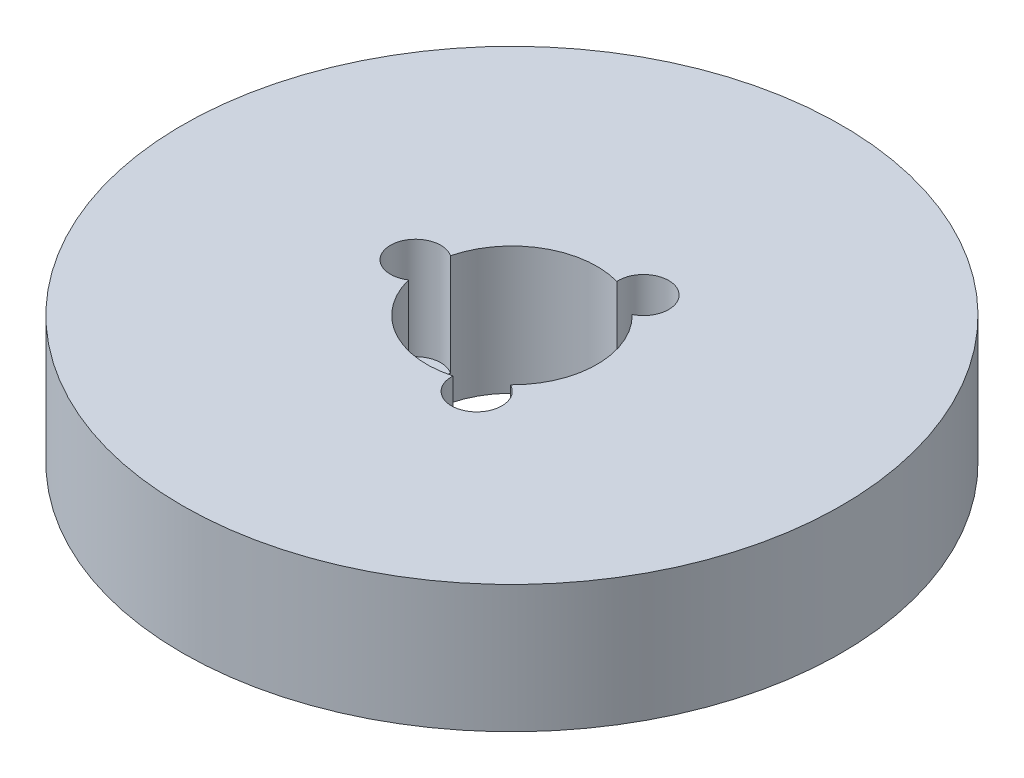
ISO-10303-21;
HEADER;
FILE_DESCRIPTION(('STEP AP214'),'2;1');
FILE_NAME('part.step','',(''),(''),'','','');
FILE_SCHEMA(('AUTOMOTIVE_DESIGN { 1 0 10303 214 1 1 1 1 }'));
ENDSEC;
DATA;
#1=APPLICATION_CONTEXT('core data for automotive mechanical design processes');
#2=APPLICATION_PROTOCOL_DEFINITION('international standard','automotive_design',2000,#1);
#3=PRODUCT_CONTEXT('',#1,'mechanical');
#4=PRODUCT('Part','Part','',(#3));
#5=PRODUCT_RELATED_PRODUCT_CATEGORY('part','',(#4));
#6=PRODUCT_DEFINITION_FORMATION('','',#4);
#7=PRODUCT_DEFINITION_CONTEXT('part definition',#1,'design');
#8=PRODUCT_DEFINITION('design','',#6,#7);
#9=PRODUCT_DEFINITION_SHAPE('','',#8);
#10=(LENGTH_UNIT() NAMED_UNIT(*) SI_UNIT(.MILLI.,.METRE.));
#11=(NAMED_UNIT(*) PLANE_ANGLE_UNIT() SI_UNIT($,.RADIAN.));
#12=(NAMED_UNIT(*) SI_UNIT($,.STERADIAN.) SOLID_ANGLE_UNIT());
#13=UNCERTAINTY_MEASURE_WITH_UNIT(LENGTH_MEASURE(1.E-05),#10,'distance_accuracy_value','');
#14=(GEOMETRIC_REPRESENTATION_CONTEXT(3) GLOBAL_UNCERTAINTY_ASSIGNED_CONTEXT((#13)) GLOBAL_UNIT_ASSIGNED_CONTEXT((#10,
#11,#12)) REPRESENTATION_CONTEXT('',''));
#15=CARTESIAN_POINT('',(0.,0.,0.));
#16=DIRECTION('',(0.,0.,1.));
#17=DIRECTION('',(1.,0.,0.));
#18=AXIS2_PLACEMENT_3D('',#15,#16,#17);
#19=CARTESIAN_POINT('',(0.,30.,0.));
#20=DIRECTION('',(0.,-1.,0.));
#21=DIRECTION('',(0.,0.,-1.));
#22=AXIS2_PLACEMENT_3D('',#19,#20,#21);
#23=CYLINDRICAL_SURFACE('',#22,77.5);
#24=CARTESIAN_POINT('',(0.,30.,0.));
#25=DIRECTION('',(0.,1.,0.));
#26=DIRECTION('',(0.,0.,1.));
#27=AXIS2_PLACEMENT_3D('',#24,#25,#26);
#28=CIRCLE('',#27,77.5);
#29=CARTESIAN_POINT('',(0.,30.,77.5));
#30=VERTEX_POINT('',#29);
#31=EDGE_CURVE('E126',#30,#30,#28,.T.);
#32=ORIENTED_EDGE('',*,*,#31,.F.);
#33=EDGE_LOOP('',(#32));
#34=FACE_BOUND('',#33,.T.);
#35=CARTESIAN_POINT('',(0.,0.,0.));
#36=DIRECTION('',(0.,1.,0.));
#37=DIRECTION('',(0.,0.,1.));
#38=AXIS2_PLACEMENT_3D('',#35,#36,#37);
#39=CIRCLE('',#38,77.5);
#40=CARTESIAN_POINT('',(0.,0.,77.5));
#41=VERTEX_POINT('',#40);
#42=EDGE_CURVE('E124',#41,#41,#39,.T.);
#43=ORIENTED_EDGE('',*,*,#42,.T.);
#44=EDGE_LOOP('',(#43));
#45=FACE_BOUND('',#44,.T.);
#46=ADVANCED_FACE('F39',(#34,#45),#23,.T.);
#47=CARTESIAN_POINT('',(0.,30.,0.));
#48=DIRECTION('',(0.,1.,0.));
#49=DIRECTION('',(0.,0.,1.));
#50=AXIS2_PLACEMENT_3D('',#47,#48,#49);
#51=PLANE('',#50);
#52=CARTESIAN_POINT('',(11.3267879559254,30.,19.6185722262219));
#53=DIRECTION('',(0.,1.,0.));
#54=DIRECTION('',(0.866025403784436,0.,-0.500000000000004));
#55=AXIS2_PLACEMENT_3D('',#52,#53,#54);
#56=CIRCLE('',#55,5.92138108372844);
#57=CARTESIAN_POINT('',(5.41673298405972,30.,19.2525064284991));
#58=VERTEX_POINT('',#57);
#59=CARTESIAN_POINT('',(13.9647931615737,30.,14.3172815839622));
#60=VERTEX_POINT('',#59);
#61=EDGE_CURVE('E147',#58,#60,#56,.T.);
#62=ORIENTED_EDGE('',*,*,#61,.F.);
#63=CARTESIAN_POINT('',(0.,30.,0.));
#64=DIRECTION('',(0.,1.,0.));
#65=DIRECTION('',(0.,0.,1.));
#66=AXIS2_PLACEMENT_3D('',#63,#64,#65);
#67=CIRCLE('',#66,20.);
#68=CARTESIAN_POINT('',(-19.3815261456333,30.,4.93522484453684));
#69=VERTEX_POINT('',#68);
#70=EDGE_CURVE('E118',#69,#58,#67,.T.);
#71=ORIENTED_EDGE('',*,*,#70,.F.);
#72=CARTESIAN_POINT('',(-22.6535759118507,30.,0.));
#73=DIRECTION('',(0.,1.,0.));
#74=DIRECTION('',(0.,0.,1.));
#75=AXIS2_PLACEMENT_3D('',#72,#73,#74);
#76=CIRCLE('',#75,5.92138108372844);
#77=CARTESIAN_POINT('',(-19.3815261456333,30.,-4.93522484453684));
#78=VERTEX_POINT('',#77);
#79=EDGE_CURVE('E113',#78,#69,#76,.T.);
#80=ORIENTED_EDGE('',*,*,#79,.F.);
#81=CARTESIAN_POINT('',(5.41673298405945,30.,-19.2525064284992));
#82=VERTEX_POINT('',#81);
#83=EDGE_CURVE('E106',#82,#78,#67,.T.);
#84=ORIENTED_EDGE('',*,*,#83,.F.);
#85=CARTESIAN_POINT('',(11.3267879559252,30.,-19.618572226222));
#86=DIRECTION('',(0.,1.,0.));
#87=DIRECTION('',(-0.866025403784443,0.,-0.499999999999992));
#88=AXIS2_PLACEMENT_3D('',#85,#86,#87);
#89=CIRCLE('',#88,5.92138108372844);
#90=CARTESIAN_POINT('',(13.9647931615735,30.,-14.3172815839624));
#91=VERTEX_POINT('',#90);
#92=EDGE_CURVE('E90',#91,#82,#89,.T.);
#93=ORIENTED_EDGE('',*,*,#92,.F.);
#94=EDGE_CURVE('E116',#60,#91,#67,.T.);
#95=ORIENTED_EDGE('',*,*,#94,.F.);
#96=EDGE_LOOP('',(#62,#71,#80,#84,#93,#95));
#97=FACE_BOUND('',#96,.T.);
#98=ORIENTED_EDGE('',*,*,#31,.T.);
#99=EDGE_LOOP('',(#98));
#100=FACE_BOUND('',#99,.T.);
#101=ADVANCED_FACE('F115',(#97,#100),#51,.T.);
#102=CARTESIAN_POINT('',(0.,0.,0.));
#103=DIRECTION('',(0.,1.,0.));
#104=DIRECTION('',(0.,0.,1.));
#105=AXIS2_PLACEMENT_3D('',#102,#103,#104);
#106=PLANE('',#105);
#107=CARTESIAN_POINT('',(0.,0.,0.));
#108=DIRECTION('',(0.,1.,0.));
#109=DIRECTION('',(0.,0.,1.));
#110=AXIS2_PLACEMENT_3D('',#107,#108,#109);
#111=CIRCLE('',#110,20.);
#112=CARTESIAN_POINT('',(0.,0.,20.));
#113=VERTEX_POINT('',#112);
#114=EDGE_CURVE('E120',#113,#113,#111,.T.);
#115=ORIENTED_EDGE('',*,*,#114,.T.);
#116=EDGE_LOOP('',(#115));
#117=FACE_BOUND('',#116,.T.);
#118=ORIENTED_EDGE('',*,*,#42,.F.);
#119=EDGE_LOOP('',(#118));
#120=FACE_BOUND('',#119,.T.);
#121=ADVANCED_FACE('F164',(#117,#120),#106,.F.);
#122=CARTESIAN_POINT('',(0.,30.,0.));
#123=DIRECTION('',(0.,-1.,0.));
#124=DIRECTION('',(0.,0.,-1.));
#125=AXIS2_PLACEMENT_3D('',#122,#123,#124);
#126=CYLINDRICAL_SURFACE('',#125,20.);
#127=DIRECTION('',(0.,1.,0.));
#128=VECTOR('',#127,1.);
#129=CARTESIAN_POINT('',(5.41673298405972,18.0374902480218,19.2525064284991));
#130=LINE('',#129,#128);
#131=CARTESIAN_POINT('',(5.41673298405972,6.07498049604365,19.2525064284991));
#132=VERTEX_POINT('',#131);
#133=EDGE_CURVE('E11',#132,#58,#130,.T.);
#134=ORIENTED_EDGE('',*,*,#133,.F.);
#135=CARTESIAN_POINT('',(0.,6.07498049604365,0.));
#136=DIRECTION('',(0.,1.,0.));
#137=DIRECTION('',(0.,0.,1.));
#138=AXIS2_PLACEMENT_3D('',#135,#136,#137);
#139=CIRCLE('',#138,20.);
#140=CARTESIAN_POINT('',(13.9647931615737,6.07498049604365,14.3172815839622));
#141=VERTEX_POINT('',#140);
#142=EDGE_CURVE('E144',#132,#141,#139,.T.);
#143=ORIENTED_EDGE('',*,*,#142,.T.);
#144=DIRECTION('',(0.,1.,0.));
#145=VECTOR('',#144,1.);
#146=CARTESIAN_POINT('',(13.9647931615737,18.0374902480218,14.3172815839622));
#147=LINE('',#146,#145);
#148=EDGE_CURVE('E46',#60,#141,#147,.F.);
#149=ORIENTED_EDGE('',*,*,#148,.F.);
#150=ORIENTED_EDGE('',*,*,#94,.T.);
#151=DIRECTION('',(0.,1.,0.));
#152=VECTOR('',#151,1.);
#153=CARTESIAN_POINT('',(13.9647931615735,18.0374902480218,-14.3172815839624));
#154=LINE('',#153,#152);
#155=CARTESIAN_POINT('',(13.9647931615735,6.07498049604365,-14.3172815839624));
#156=VERTEX_POINT('',#155);
#157=EDGE_CURVE('E92',#156,#91,#154,.T.);
#158=ORIENTED_EDGE('',*,*,#157,.F.);
#159=CARTESIAN_POINT('',(0.,6.07498049604365,0.));
#160=DIRECTION('',(0.,1.,0.));
#161=DIRECTION('',(0.,0.,1.));
#162=AXIS2_PLACEMENT_3D('',#159,#160,#161);
#163=CIRCLE('',#162,20.);
#164=CARTESIAN_POINT('',(5.41673298405945,6.07498049604365,-19.2525064284992));
#165=VERTEX_POINT('',#164);
#166=EDGE_CURVE('E107',#156,#165,#163,.T.);
#167=ORIENTED_EDGE('',*,*,#166,.T.);
#168=DIRECTION('',(0.,1.,0.));
#169=VECTOR('',#168,1.);
#170=CARTESIAN_POINT('',(5.41673298405945,18.0374902480218,-19.2525064284992));
#171=LINE('',#170,#169);
#172=EDGE_CURVE('E95',#82,#165,#171,.F.);
#173=ORIENTED_EDGE('',*,*,#172,.F.);
#174=ORIENTED_EDGE('',*,*,#83,.T.);
#175=DIRECTION('',(0.,1.,0.));
#176=VECTOR('',#175,1.);
#177=CARTESIAN_POINT('',(-19.3815261456333,18.0374902480218,-4.93522484453684));
#178=LINE('',#177,#176);
#179=CARTESIAN_POINT('',(-19.3815261456333,6.07498049604365,-4.93522484453684));
#180=VERTEX_POINT('',#179);
#181=EDGE_CURVE('E143',#180,#78,#178,.T.);
#182=ORIENTED_EDGE('',*,*,#181,.F.);
#183=CARTESIAN_POINT('',(0.,6.07498049604365,0.));
#184=DIRECTION('',(0.,1.,0.));
#185=DIRECTION('',(0.,0.,1.));
#186=AXIS2_PLACEMENT_3D('',#183,#184,#185);
#187=CIRCLE('',#186,20.);
#188=CARTESIAN_POINT('',(-19.3815261456333,6.07498049604365,4.93522484453684));
#189=VERTEX_POINT('',#188);
#190=EDGE_CURVE('E132',#180,#189,#187,.T.);
#191=ORIENTED_EDGE('',*,*,#190,.T.);
#192=DIRECTION('',(0.,1.,0.));
#193=VECTOR('',#192,1.);
#194=CARTESIAN_POINT('',(-19.3815261456333,18.0374902480218,4.93522484453684));
#195=LINE('',#194,#193);
#196=EDGE_CURVE('E137',#69,#189,#195,.F.);
#197=ORIENTED_EDGE('',*,*,#196,.F.);
#198=ORIENTED_EDGE('',*,*,#70,.T.);
#199=EDGE_LOOP('',(#134,#143,#149,#150,#158,#167,#173,#174,#182,#191,#197,#198));
#200=FACE_BOUND('',#199,.T.);
#201=ORIENTED_EDGE('',*,*,#114,.F.);
#202=EDGE_LOOP('',(#201));
#203=FACE_BOUND('',#202,.T.);
#204=ADVANCED_FACE('F103',(#200,#203),#126,.F.);
#205=CARTESIAN_POINT('',(-22.6535759118507,6.07498049604365,0.));
#206=DIRECTION('',(0.,1.,0.));
#207=DIRECTION('',(0.,0.,1.));
#208=AXIS2_PLACEMENT_3D('',#205,#206,#207);
#209=CYLINDRICAL_SURFACE('',#208,5.92138108372844);
#210=ORIENTED_EDGE('',*,*,#181,.T.);
#211=ORIENTED_EDGE('',*,*,#79,.T.);
#212=ORIENTED_EDGE('',*,*,#196,.T.);
#213=CARTESIAN_POINT('',(-22.6535759118507,6.07498049604365,0.));
#214=DIRECTION('',(0.,1.,0.));
#215=DIRECTION('',(0.,0.,1.));
#216=AXIS2_PLACEMENT_3D('',#213,#214,#215);
#217=CIRCLE('',#216,5.92138108372844);
#218=EDGE_CURVE('E121',#180,#189,#217,.T.);
#219=ORIENTED_EDGE('',*,*,#218,.F.);
#220=EDGE_LOOP('',(#210,#211,#212,#219));
#221=FACE_BOUND('',#220,.T.);
#222=ADVANCED_FACE('F174',(#221),#209,.F.);
#223=CARTESIAN_POINT('',(-22.6535759118507,6.07498049604365,0.));
#224=DIRECTION('',(0.,1.,0.));
#225=DIRECTION('',(0.,0.,1.));
#226=AXIS2_PLACEMENT_3D('',#223,#224,#225);
#227=PLANE('',#226);
#228=ORIENTED_EDGE('',*,*,#218,.T.);
#229=ORIENTED_EDGE('',*,*,#190,.F.);
#230=EDGE_LOOP('',(#228,#229));
#231=FACE_BOUND('',#230,.T.);
#232=ADVANCED_FACE('F177',(#231),#227,.T.);
#233=CARTESIAN_POINT('',(11.3267879559252,6.07498049604365,-19.618572226222));
#234=DIRECTION('',(0.,1.,0.));
#235=DIRECTION('',(0.,0.,1.));
#236=AXIS2_PLACEMENT_3D('',#233,#234,#235);
#237=CYLINDRICAL_SURFACE('',#236,5.92138108372844);
#238=ORIENTED_EDGE('',*,*,#157,.T.);
#239=ORIENTED_EDGE('',*,*,#92,.T.);
#240=ORIENTED_EDGE('',*,*,#172,.T.);
#241=CARTESIAN_POINT('',(11.3267879559252,6.07498049604365,-19.618572226222));
#242=DIRECTION('',(0.,1.,0.));
#243=DIRECTION('',(-0.866025403784443,0.,-0.499999999999992));
#244=AXIS2_PLACEMENT_3D('',#241,#242,#243);
#245=CIRCLE('',#244,5.92138108372844);
#246=EDGE_CURVE('E56',#156,#165,#245,.T.);
#247=ORIENTED_EDGE('',*,*,#246,.F.);
#248=EDGE_LOOP('',(#238,#239,#240,#247));
#249=FACE_BOUND('',#248,.T.);
#250=ADVANCED_FACE('F93',(#249),#237,.F.);
#251=CARTESIAN_POINT('',(11.3267879559252,6.07498049604365,-19.618572226222));
#252=DIRECTION('',(0.,1.,0.));
#253=DIRECTION('',(-0.866025403784443,0.,-0.499999999999992));
#254=AXIS2_PLACEMENT_3D('',#251,#252,#253);
#255=PLANE('',#254);
#256=ORIENTED_EDGE('',*,*,#246,.T.);
#257=ORIENTED_EDGE('',*,*,#166,.F.);
#258=EDGE_LOOP('',(#256,#257));
#259=FACE_BOUND('',#258,.T.);
#260=ADVANCED_FACE('F160',(#259),#255,.T.);
#261=CARTESIAN_POINT('',(11.3267879559254,6.07498049604365,19.6185722262219));
#262=DIRECTION('',(0.,1.,0.));
#263=DIRECTION('',(0.,0.,1.));
#264=AXIS2_PLACEMENT_3D('',#261,#262,#263);
#265=CYLINDRICAL_SURFACE('',#264,5.92138108372844);
#266=ORIENTED_EDGE('',*,*,#133,.T.);
#267=ORIENTED_EDGE('',*,*,#61,.T.);
#268=ORIENTED_EDGE('',*,*,#148,.T.);
#269=CARTESIAN_POINT('',(11.3267879559254,6.07498049604365,19.6185722262219));
#270=DIRECTION('',(0.,1.,0.));
#271=DIRECTION('',(0.866025403784436,0.,-0.500000000000004));
#272=AXIS2_PLACEMENT_3D('',#269,#270,#271);
#273=CIRCLE('',#272,5.92138108372844);
#274=EDGE_CURVE('E55',#132,#141,#273,.T.);
#275=ORIENTED_EDGE('',*,*,#274,.F.);
#276=EDGE_LOOP('',(#266,#267,#268,#275));
#277=FACE_BOUND('',#276,.T.);
#278=ADVANCED_FACE('F149',(#277),#265,.F.);
#279=CARTESIAN_POINT('',(11.3267879559254,6.07498049604365,19.6185722262219));
#280=DIRECTION('',(0.,1.,0.));
#281=DIRECTION('',(0.866025403784436,0.,-0.500000000000004));
#282=AXIS2_PLACEMENT_3D('',#279,#280,#281);
#283=PLANE('',#282);
#284=ORIENTED_EDGE('',*,*,#274,.T.);
#285=ORIENTED_EDGE('',*,*,#142,.F.);
#286=EDGE_LOOP('',(#284,#285));
#287=FACE_BOUND('',#286,.T.);
#288=ADVANCED_FACE('F151',(#287),#283,.T.);
#289=CLOSED_SHELL('',(#46,#101,#121,#204,#222,#232,#250,#260,#278,#288));
#290=MANIFOLD_SOLID_BREP('B2',#289);
#291=ADVANCED_BREP_SHAPE_REPRESENTATION('',(#18,#290),#14);
#292=SHAPE_DEFINITION_REPRESENTATION(#9,#291);
ENDSEC;
END-ISO-10303-21;
